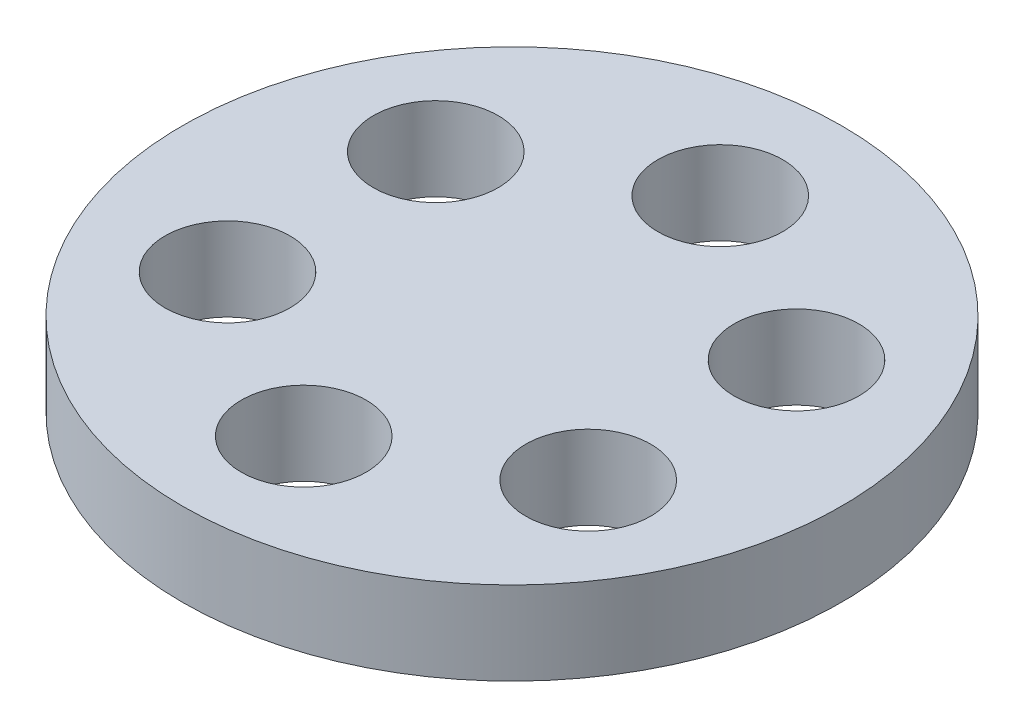
ISO-10303-21;
HEADER;
FILE_DESCRIPTION(('STEP AP214'),'2;1');
FILE_NAME('part.step','',(''),(''),'','','');
FILE_SCHEMA(('AUTOMOTIVE_DESIGN { 1 0 10303 214 1 1 1 1 }'));
ENDSEC;
DATA;
#1=APPLICATION_CONTEXT('core data for automotive mechanical design processes');
#2=APPLICATION_PROTOCOL_DEFINITION('international standard','automotive_design',2000,#1);
#3=PRODUCT_CONTEXT('',#1,'mechanical');
#4=PRODUCT('Part','Part','',(#3));
#5=PRODUCT_RELATED_PRODUCT_CATEGORY('part','',(#4));
#6=PRODUCT_DEFINITION_FORMATION('','',#4);
#7=PRODUCT_DEFINITION_CONTEXT('part definition',#1,'design');
#8=PRODUCT_DEFINITION('design','',#6,#7);
#9=PRODUCT_DEFINITION_SHAPE('','',#8);
#10=(LENGTH_UNIT() NAMED_UNIT(*) SI_UNIT(.MILLI.,.METRE.));
#11=(NAMED_UNIT(*) PLANE_ANGLE_UNIT() SI_UNIT($,.RADIAN.));
#12=(NAMED_UNIT(*) SI_UNIT($,.STERADIAN.) SOLID_ANGLE_UNIT());
#13=UNCERTAINTY_MEASURE_WITH_UNIT(LENGTH_MEASURE(1.E-05),#10,'distance_accuracy_value','');
#14=(GEOMETRIC_REPRESENTATION_CONTEXT(3) GLOBAL_UNCERTAINTY_ASSIGNED_CONTEXT((#13)) GLOBAL_UNIT_ASSIGNED_CONTEXT((#10,
#11,#12)) REPRESENTATION_CONTEXT('',''));
#15=CARTESIAN_POINT('',(0.,0.,0.));
#16=DIRECTION('',(0.,0.,1.));
#17=DIRECTION('',(1.,0.,0.));
#18=AXIS2_PLACEMENT_3D('',#15,#16,#17);
#19=CARTESIAN_POINT('',(27.4963065701559,12.7,-15.875));
#20=DIRECTION('',(0.,-1.,0.));
#21=DIRECTION('',(0.,0.,-1.));
#22=AXIS2_PLACEMENT_3D('',#19,#20,#21);
#23=CYLINDRICAL_SURFACE('',#22,9.52500000000008);
#24=CARTESIAN_POINT('',(27.4963065701559,12.7,-15.875));
#25=DIRECTION('',(0.,1.,0.));
#26=DIRECTION('',(0.,0.,1.));
#27=AXIS2_PLACEMENT_3D('',#24,#25,#26);
#28=CIRCLE('',#27,9.52500000000008);
#29=CARTESIAN_POINT('',(27.4963065701559,12.7,-6.34999999999993));
#30=VERTEX_POINT('',#29);
#31=EDGE_CURVE('E52',#30,#30,#28,.T.);
#32=ORIENTED_EDGE('',*,*,#31,.T.);
#33=EDGE_LOOP('',(#32));
#34=FACE_BOUND('',#33,.T.);
#35=CARTESIAN_POINT('',(27.4963065701559,0.,-15.875));
#36=DIRECTION('',(0.,1.,0.));
#37=DIRECTION('',(0.,0.,1.));
#38=AXIS2_PLACEMENT_3D('',#35,#36,#37);
#39=CIRCLE('',#38,9.52500000000008);
#40=CARTESIAN_POINT('',(27.4963065701559,0.,-6.34999999999993));
#41=VERTEX_POINT('',#40);
#42=EDGE_CURVE('E81',#41,#41,#39,.T.);
#43=ORIENTED_EDGE('',*,*,#42,.F.);
#44=EDGE_LOOP('',(#43));
#45=FACE_BOUND('',#44,.T.);
#46=ADVANCED_FACE('F43',(#34,#45),#23,.F.);
#47=CARTESIAN_POINT('',(27.4963065701559,12.7,15.875));
#48=DIRECTION('',(0.,-1.,0.));
#49=DIRECTION('',(0.,0.,-1.));
#50=AXIS2_PLACEMENT_3D('',#47,#48,#49);
#51=CYLINDRICAL_SURFACE('',#50,9.52500000000016);
#52=CARTESIAN_POINT('',(27.4963065701559,12.7,15.875));
#53=DIRECTION('',(0.,1.,0.));
#54=DIRECTION('',(0.,0.,1.));
#55=AXIS2_PLACEMENT_3D('',#52,#53,#54);
#56=CIRCLE('',#55,9.52500000000016);
#57=CARTESIAN_POINT('',(27.4963065701559,12.7,25.4000000000002));
#58=VERTEX_POINT('',#57);
#59=EDGE_CURVE('E58',#58,#58,#56,.T.);
#60=ORIENTED_EDGE('',*,*,#59,.T.);
#61=EDGE_LOOP('',(#60));
#62=FACE_BOUND('',#61,.T.);
#63=CARTESIAN_POINT('',(27.4963065701559,0.,15.875));
#64=DIRECTION('',(0.,1.,0.));
#65=DIRECTION('',(0.,0.,1.));
#66=AXIS2_PLACEMENT_3D('',#63,#64,#65);
#67=CIRCLE('',#66,9.52500000000016);
#68=CARTESIAN_POINT('',(27.4963065701559,0.,25.4000000000002));
#69=VERTEX_POINT('',#68);
#70=EDGE_CURVE('E78',#69,#69,#67,.T.);
#71=ORIENTED_EDGE('',*,*,#70,.F.);
#72=EDGE_LOOP('',(#71));
#73=FACE_BOUND('',#72,.T.);
#74=ADVANCED_FACE('F112',(#62,#73),#51,.F.);
#75=CARTESIAN_POINT('',(0.,12.7,31.75));
#76=DIRECTION('',(0.,-1.,0.));
#77=DIRECTION('',(0.,0.,-1.));
#78=AXIS2_PLACEMENT_3D('',#75,#76,#77);
#79=CYLINDRICAL_SURFACE('',#78,9.52500000000022);
#80=CARTESIAN_POINT('',(0.,12.7,31.75));
#81=DIRECTION('',(0.,1.,0.));
#82=DIRECTION('',(0.,0.,1.));
#83=AXIS2_PLACEMENT_3D('',#80,#81,#82);
#84=CIRCLE('',#83,9.52500000000022);
#85=CARTESIAN_POINT('',(0.,12.7,41.2750000000002));
#86=VERTEX_POINT('',#85);
#87=EDGE_CURVE('E105',#86,#86,#84,.T.);
#88=ORIENTED_EDGE('',*,*,#87,.T.);
#89=EDGE_LOOP('',(#88));
#90=FACE_BOUND('',#89,.T.);
#91=CARTESIAN_POINT('',(0.,0.,31.75));
#92=DIRECTION('',(0.,1.,0.));
#93=DIRECTION('',(0.,0.,1.));
#94=AXIS2_PLACEMENT_3D('',#91,#92,#93);
#95=CIRCLE('',#94,9.52500000000022);
#96=CARTESIAN_POINT('',(0.,0.,41.2750000000002));
#97=VERTEX_POINT('',#96);
#98=EDGE_CURVE('E74',#97,#97,#95,.T.);
#99=ORIENTED_EDGE('',*,*,#98,.F.);
#100=EDGE_LOOP('',(#99));
#101=FACE_BOUND('',#100,.T.);
#102=ADVANCED_FACE('F130',(#90,#101),#79,.F.);
#103=CARTESIAN_POINT('',(-27.4963065701559,12.7,15.875));
#104=DIRECTION('',(0.,-1.,0.));
#105=DIRECTION('',(0.,0.,-1.));
#106=AXIS2_PLACEMENT_3D('',#103,#104,#105);
#107=CYLINDRICAL_SURFACE('',#106,9.5250000000003);
#108=CARTESIAN_POINT('',(-27.4963065701559,12.7,15.875));
#109=DIRECTION('',(0.,1.,0.));
#110=DIRECTION('',(0.,0.,1.));
#111=AXIS2_PLACEMENT_3D('',#108,#109,#110);
#112=CIRCLE('',#111,9.5250000000003);
#113=CARTESIAN_POINT('',(-27.4963065701559,12.7,25.4000000000003));
#114=VERTEX_POINT('',#113);
#115=EDGE_CURVE('E99',#114,#114,#112,.T.);
#116=ORIENTED_EDGE('',*,*,#115,.T.);
#117=EDGE_LOOP('',(#116));
#118=FACE_BOUND('',#117,.T.);
#119=CARTESIAN_POINT('',(-27.4963065701559,0.,15.875));
#120=DIRECTION('',(0.,1.,0.));
#121=DIRECTION('',(0.,0.,1.));
#122=AXIS2_PLACEMENT_3D('',#119,#120,#121);
#123=CIRCLE('',#122,9.5250000000003);
#124=CARTESIAN_POINT('',(-27.4963065701559,0.,25.4000000000003));
#125=VERTEX_POINT('',#124);
#126=EDGE_CURVE('E70',#125,#125,#123,.T.);
#127=ORIENTED_EDGE('',*,*,#126,.F.);
#128=EDGE_LOOP('',(#127));
#129=FACE_BOUND('',#128,.T.);
#130=ADVANCED_FACE('F137',(#118,#129),#107,.F.);
#131=CARTESIAN_POINT('',(-27.4963065701559,12.7,-15.875));
#132=DIRECTION('',(0.,-1.,0.));
#133=DIRECTION('',(0.,0.,-1.));
#134=AXIS2_PLACEMENT_3D('',#131,#132,#133);
#135=CYLINDRICAL_SURFACE('',#134,9.52500000000038);
#136=CARTESIAN_POINT('',(-27.4963065701559,12.7,-15.875));
#137=DIRECTION('',(0.,1.,0.));
#138=DIRECTION('',(0.,0.,1.));
#139=AXIS2_PLACEMENT_3D('',#136,#137,#138);
#140=CIRCLE('',#139,9.52500000000038);
#141=CARTESIAN_POINT('',(-27.4963065701559,12.7,-6.3499999999996));
#142=VERTEX_POINT('',#141);
#143=EDGE_CURVE('E93',#142,#142,#140,.T.);
#144=ORIENTED_EDGE('',*,*,#143,.T.);
#145=EDGE_LOOP('',(#144));
#146=FACE_BOUND('',#145,.T.);
#147=CARTESIAN_POINT('',(-27.4963065701559,0.,-15.875));
#148=DIRECTION('',(0.,1.,0.));
#149=DIRECTION('',(0.,0.,1.));
#150=AXIS2_PLACEMENT_3D('',#147,#148,#149);
#151=CIRCLE('',#150,9.52500000000038);
#152=CARTESIAN_POINT('',(-27.4963065701559,0.,-6.3499999999996));
#153=VERTEX_POINT('',#152);
#154=EDGE_CURVE('E66',#153,#153,#151,.T.);
#155=ORIENTED_EDGE('',*,*,#154,.F.);
#156=EDGE_LOOP('',(#155));
#157=FACE_BOUND('',#156,.T.);
#158=ADVANCED_FACE('F140',(#146,#157),#135,.F.);
#159=CARTESIAN_POINT('',(0.,12.7,-31.75));
#160=DIRECTION('',(0.,-1.,0.));
#161=DIRECTION('',(0.,0.,-1.));
#162=AXIS2_PLACEMENT_3D('',#159,#160,#161);
#163=CYLINDRICAL_SURFACE('',#162,9.525);
#164=CARTESIAN_POINT('',(0.,12.7,-31.75));
#165=DIRECTION('',(0.,1.,0.));
#166=DIRECTION('',(0.,0.,1.));
#167=AXIS2_PLACEMENT_3D('',#164,#165,#166);
#168=CIRCLE('',#167,9.525);
#169=CARTESIAN_POINT('',(0.,12.7,-22.225));
#170=VERTEX_POINT('',#169);
#171=EDGE_CURVE('E88',#170,#170,#168,.T.);
#172=ORIENTED_EDGE('',*,*,#171,.T.);
#173=EDGE_LOOP('',(#172));
#174=FACE_BOUND('',#173,.T.);
#175=CARTESIAN_POINT('',(0.,0.,-31.75));
#176=DIRECTION('',(0.,1.,0.));
#177=DIRECTION('',(0.,0.,1.));
#178=AXIS2_PLACEMENT_3D('',#175,#176,#177);
#179=CIRCLE('',#178,9.525);
#180=CARTESIAN_POINT('',(0.,0.,-22.225));
#181=VERTEX_POINT('',#180);
#182=EDGE_CURVE('E62',#181,#181,#179,.T.);
#183=ORIENTED_EDGE('',*,*,#182,.F.);
#184=EDGE_LOOP('',(#183));
#185=FACE_BOUND('',#184,.T.);
#186=ADVANCED_FACE('F45',(#174,#185),#163,.F.);
#187=CARTESIAN_POINT('',(0.,12.7,0.));
#188=DIRECTION('',(0.,-1.,0.));
#189=DIRECTION('',(0.,0.,-1.));
#190=AXIS2_PLACEMENT_3D('',#187,#188,#189);
#191=CYLINDRICAL_SURFACE('',#190,50.2412);
#192=CARTESIAN_POINT('',(0.,12.7,0.));
#193=DIRECTION('',(0.,1.,0.));
#194=DIRECTION('',(0.,0.,1.));
#195=AXIS2_PLACEMENT_3D('',#192,#193,#194);
#196=CIRCLE('',#195,50.2412);
#197=CARTESIAN_POINT('',(0.,12.7,50.2412));
#198=VERTEX_POINT('',#197);
#199=EDGE_CURVE('E10',#198,#198,#196,.T.);
#200=ORIENTED_EDGE('',*,*,#199,.F.);
#201=EDGE_LOOP('',(#200));
#202=FACE_BOUND('',#201,.T.);
#203=CARTESIAN_POINT('',(0.,0.,0.));
#204=DIRECTION('',(0.,1.,0.));
#205=DIRECTION('',(0.,0.,1.));
#206=AXIS2_PLACEMENT_3D('',#203,#204,#205);
#207=CIRCLE('',#206,50.2412);
#208=CARTESIAN_POINT('',(0.,0.,50.2412));
#209=VERTEX_POINT('',#208);
#210=EDGE_CURVE('E47',#209,#209,#207,.T.);
#211=ORIENTED_EDGE('',*,*,#210,.T.);
#212=EDGE_LOOP('',(#211));
#213=FACE_BOUND('',#212,.T.);
#214=ADVANCED_FACE('F119',(#202,#213),#191,.T.);
#215=CARTESIAN_POINT('',(0.,12.7,0.));
#216=DIRECTION('',(0.,1.,0.));
#217=DIRECTION('',(0.,0.,1.));
#218=AXIS2_PLACEMENT_3D('',#215,#216,#217);
#219=PLANE('',#218);
#220=ORIENTED_EDGE('',*,*,#171,.F.);
#221=EDGE_LOOP('',(#220));
#222=FACE_BOUND('',#221,.T.);
#223=ORIENTED_EDGE('',*,*,#143,.F.);
#224=EDGE_LOOP('',(#223));
#225=FACE_BOUND('',#224,.T.);
#226=ORIENTED_EDGE('',*,*,#115,.F.);
#227=EDGE_LOOP('',(#226));
#228=FACE_BOUND('',#227,.T.);
#229=ORIENTED_EDGE('',*,*,#87,.F.);
#230=EDGE_LOOP('',(#229));
#231=FACE_BOUND('',#230,.T.);
#232=ORIENTED_EDGE('',*,*,#59,.F.);
#233=EDGE_LOOP('',(#232));
#234=FACE_BOUND('',#233,.T.);
#235=ORIENTED_EDGE('',*,*,#31,.F.);
#236=EDGE_LOOP('',(#235));
#237=FACE_BOUND('',#236,.T.);
#238=ORIENTED_EDGE('',*,*,#199,.T.);
#239=EDGE_LOOP('',(#238));
#240=FACE_BOUND('',#239,.T.);
#241=ADVANCED_FACE('F115',(#222,#225,#228,#231,#234,#237,#240),#219,.T.);
#242=CARTESIAN_POINT('',(0.,0.,0.));
#243=DIRECTION('',(0.,1.,0.));
#244=DIRECTION('',(0.,0.,1.));
#245=AXIS2_PLACEMENT_3D('',#242,#243,#244);
#246=PLANE('',#245);
#247=ORIENTED_EDGE('',*,*,#182,.T.);
#248=EDGE_LOOP('',(#247));
#249=FACE_BOUND('',#248,.T.);
#250=ORIENTED_EDGE('',*,*,#154,.T.);
#251=EDGE_LOOP('',(#250));
#252=FACE_BOUND('',#251,.T.);
#253=ORIENTED_EDGE('',*,*,#126,.T.);
#254=EDGE_LOOP('',(#253));
#255=FACE_BOUND('',#254,.T.);
#256=ORIENTED_EDGE('',*,*,#98,.T.);
#257=EDGE_LOOP('',(#256));
#258=FACE_BOUND('',#257,.T.);
#259=ORIENTED_EDGE('',*,*,#70,.T.);
#260=EDGE_LOOP('',(#259));
#261=FACE_BOUND('',#260,.T.);
#262=ORIENTED_EDGE('',*,*,#42,.T.);
#263=EDGE_LOOP('',(#262));
#264=FACE_BOUND('',#263,.T.);
#265=ORIENTED_EDGE('',*,*,#210,.F.);
#266=EDGE_LOOP('',(#265));
#267=FACE_BOUND('',#266,.T.);
#268=ADVANCED_FACE('F118',(#249,#252,#255,#258,#261,#264,#267),#246,.F.);
#269=CLOSED_SHELL('',(#46,#74,#102,#130,#158,#186,#214,#241,#268));
#270=MANIFOLD_SOLID_BREP('B2',#269);
#271=ADVANCED_BREP_SHAPE_REPRESENTATION('',(#18,#270),#14);
#272=SHAPE_DEFINITION_REPRESENTATION(#9,#271);
ENDSEC;
END-ISO-10303-21;
